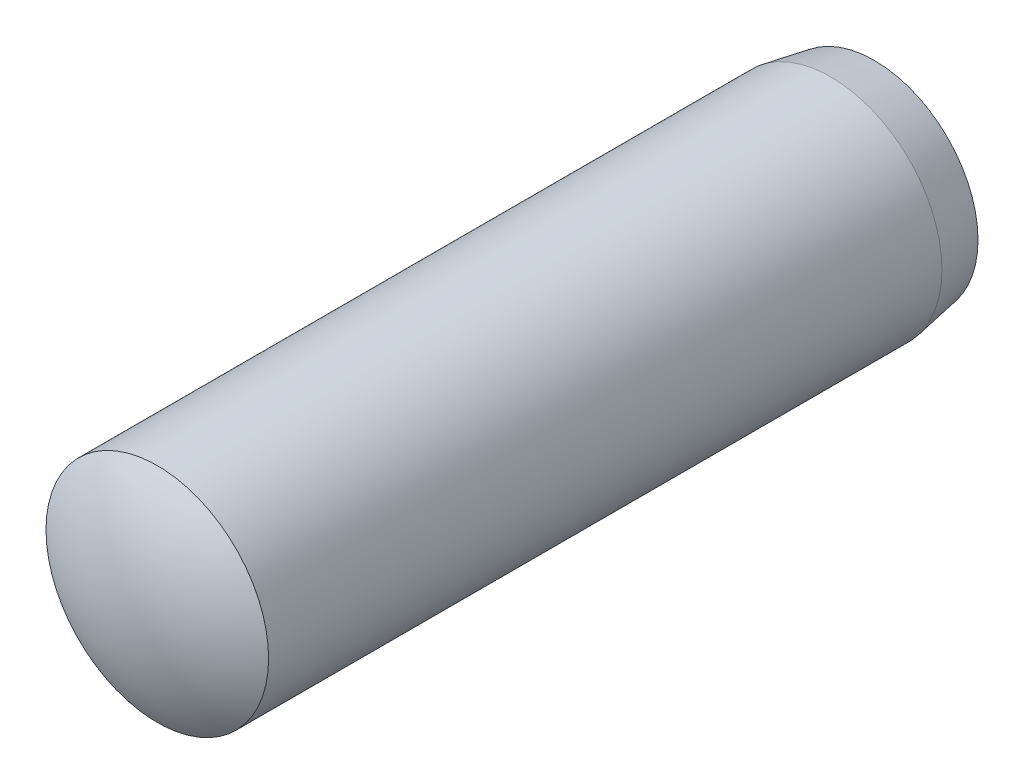
ISO-10303-21;
HEADER;
FILE_DESCRIPTION(('STEP AP214'),'2;1');
FILE_NAME('part.step','',(''),(''),'','','');
FILE_SCHEMA(('AUTOMOTIVE_DESIGN { 1 0 10303 214 1 1 1 1 }'));
ENDSEC;
DATA;
#1=APPLICATION_CONTEXT('core data for automotive mechanical design processes');
#2=APPLICATION_PROTOCOL_DEFINITION('international standard','automotive_design',2000,#1);
#3=PRODUCT_CONTEXT('',#1,'mechanical');
#4=PRODUCT('Part','Part','',(#3));
#5=PRODUCT_RELATED_PRODUCT_CATEGORY('part','',(#4));
#6=PRODUCT_DEFINITION_FORMATION('','',#4);
#7=PRODUCT_DEFINITION_CONTEXT('part definition',#1,'design');
#8=PRODUCT_DEFINITION('design','',#6,#7);
#9=PRODUCT_DEFINITION_SHAPE('','',#8);
#10=(LENGTH_UNIT() NAMED_UNIT(*) SI_UNIT(.MILLI.,.METRE.));
#11=(NAMED_UNIT(*) PLANE_ANGLE_UNIT() SI_UNIT($,.RADIAN.));
#12=(NAMED_UNIT(*) SI_UNIT($,.STERADIAN.) SOLID_ANGLE_UNIT());
#13=UNCERTAINTY_MEASURE_WITH_UNIT(LENGTH_MEASURE(1.E-05),#10,'distance_accuracy_value','');
#14=(GEOMETRIC_REPRESENTATION_CONTEXT(3) GLOBAL_UNCERTAINTY_ASSIGNED_CONTEXT((#13)) GLOBAL_UNIT_ASSIGNED_CONTEXT((#10,
#11,#12)) REPRESENTATION_CONTEXT('',''));
#15=CARTESIAN_POINT('',(0.,0.,0.));
#16=DIRECTION('',(0.,0.,1.));
#17=DIRECTION('',(1.,0.,0.));
#18=AXIS2_PLACEMENT_3D('',#15,#16,#17);
#19=CARTESIAN_POINT('',(0.,0.,-6.73333333333333));
#20=DIRECTION('',(0.,0.,-1.));
#21=DIRECTION('',(1.,0.,0.));
#22=AXIS2_PLACEMENT_3D('',#19,#20,#21);
#23=SPHERICAL_SURFACE('',#22,7.26666666666667);
#24=CARTESIAN_POINT('',(0.,0.,-12.9741616678273));
#25=DIRECTION('',(0.,0.,-1.));
#26=DIRECTION('',(-1.,0.,0.));
#27=AXIS2_PLACEMENT_3D('',#24,#25,#26);
#28=CIRCLE('',#27,3.72243282596503);
#29=CARTESIAN_POINT('',(-3.72243282596503,0.,-12.9741616678273));
#30=VERTEX_POINT('',#29);
#31=EDGE_CURVE('E10',#30,#30,#28,.T.);
#32=ORIENTED_EDGE('',*,*,#31,.T.);
#33=EDGE_LOOP('',(#32));
#34=FACE_BOUND('',#33,.T.);
#35=ADVANCED_FACE('F32',(#34),#23,.T.);
#36=CARTESIAN_POINT('',(0.,0.,-12.9741616678273));
#37=DIRECTION('',(0.,0.,1.));
#38=DIRECTION('',(1.,0.,0.));
#39=AXIS2_PLACEMENT_3D('',#36,#37,#38);
#40=CONICAL_SURFACE('',#39,3.72243282596503,0.174532925199425);
#41=CARTESIAN_POINT('',(0.,0.,-11.4));
#42=DIRECTION('',(0.,0.,-1.));
#43=DIRECTION('',(-1.,0.,0.));
#44=AXIS2_PLACEMENT_3D('',#41,#42,#43);
#45=CIRCLE('',#44,4.);
#46=CARTESIAN_POINT('',(-4.,0.,-11.4));
#47=VERTEX_POINT('',#46);
#48=EDGE_CURVE('E38',#47,#47,#45,.T.);
#49=ORIENTED_EDGE('',*,*,#48,.T.);
#50=EDGE_LOOP('',(#49));
#51=FACE_BOUND('',#50,.T.);
#52=ORIENTED_EDGE('',*,*,#31,.F.);
#53=EDGE_LOOP('',(#52));
#54=FACE_BOUND('',#53,.T.);
#55=ADVANCED_FACE('F58',(#51,#54),#40,.T.);
#56=CARTESIAN_POINT('',(0.,0.,-14.));
#57=DIRECTION('',(0.,0.,-1.));
#58=DIRECTION('',(-1.,0.,0.));
#59=AXIS2_PLACEMENT_3D('',#56,#57,#58);
#60=CYLINDRICAL_SURFACE('',#59,4.);
#61=CARTESIAN_POINT('',(0.,0.,12.8));
#62=DIRECTION('',(0.,0.,-1.));
#63=DIRECTION('',(-1.,0.,0.));
#64=AXIS2_PLACEMENT_3D('',#61,#62,#63);
#65=CIRCLE('',#64,4.);
#66=CARTESIAN_POINT('',(-3.99999999999999,0.,12.8));
#67=VERTEX_POINT('',#66);
#68=EDGE_CURVE('E42',#67,#67,#65,.T.);
#69=ORIENTED_EDGE('',*,*,#68,.T.);
#70=EDGE_LOOP('',(#69));
#71=FACE_BOUND('',#70,.T.);
#72=ORIENTED_EDGE('',*,*,#48,.F.);
#73=EDGE_LOOP('',(#72));
#74=FACE_BOUND('',#73,.T.);
#75=ADVANCED_FACE('F49',(#71,#74),#60,.T.);
#76=CARTESIAN_POINT('',(0.,0.,6.73333333333334));
#77=DIRECTION('',(0.,0.,-1.));
#78=DIRECTION('',(-1.,0.,0.));
#79=AXIS2_PLACEMENT_3D('',#76,#77,#78);
#80=SPHERICAL_SURFACE('',#79,7.26666666666666);
#81=ORIENTED_EDGE('',*,*,#68,.F.);
#82=EDGE_LOOP('',(#81));
#83=FACE_BOUND('',#82,.T.);
#84=ADVANCED_FACE('F52',(#83),#80,.T.);
#85=CLOSED_SHELL('',(#35,#55,#75,#84));
#86=MANIFOLD_SOLID_BREP('B2',#85);
#87=ADVANCED_BREP_SHAPE_REPRESENTATION('',(#18,#86),#14);
#88=SHAPE_DEFINITION_REPRESENTATION(#9,#87);
ENDSEC;
END-ISO-10303-21;
